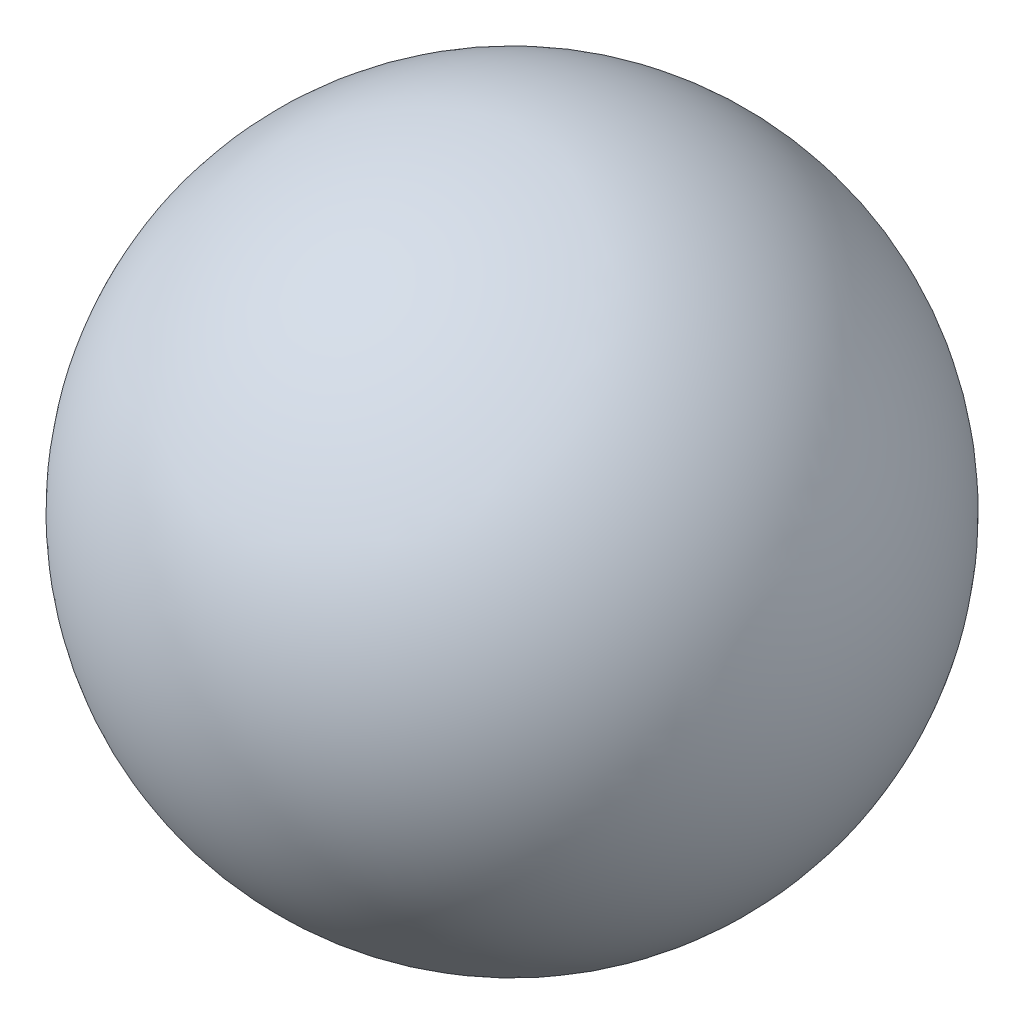
ISO-10303-21;
HEADER;
FILE_DESCRIPTION(('STEP AP214'),'2;1');
FILE_NAME('part.step','',(''),(''),'','','');
FILE_SCHEMA(('AUTOMOTIVE_DESIGN { 1 0 10303 214 1 1 1 1 }'));
ENDSEC;
DATA;
#1=APPLICATION_CONTEXT('core data for automotive mechanical design processes');
#2=APPLICATION_PROTOCOL_DEFINITION('international standard','automotive_design',2000,#1);
#3=PRODUCT_CONTEXT('',#1,'mechanical');
#4=PRODUCT('Part','Part','',(#3));
#5=PRODUCT_RELATED_PRODUCT_CATEGORY('part','',(#4));
#6=PRODUCT_DEFINITION_FORMATION('','',#4);
#7=PRODUCT_DEFINITION_CONTEXT('part definition',#1,'design');
#8=PRODUCT_DEFINITION('design','',#6,#7);
#9=PRODUCT_DEFINITION_SHAPE('','',#8);
#10=(LENGTH_UNIT() NAMED_UNIT(*) SI_UNIT(.MILLI.,.METRE.));
#11=(NAMED_UNIT(*) PLANE_ANGLE_UNIT() SI_UNIT($,.RADIAN.));
#12=(NAMED_UNIT(*) SI_UNIT($,.STERADIAN.) SOLID_ANGLE_UNIT());
#13=UNCERTAINTY_MEASURE_WITH_UNIT(LENGTH_MEASURE(1.E-05),#10,'distance_accuracy_value','');
#14=(GEOMETRIC_REPRESENTATION_CONTEXT(3) GLOBAL_UNCERTAINTY_ASSIGNED_CONTEXT((#13)) GLOBAL_UNIT_ASSIGNED_CONTEXT((#10,
#11,#12)) REPRESENTATION_CONTEXT('',''));
#15=CARTESIAN_POINT('',(0.,0.,0.));
#16=DIRECTION('',(0.,0.,1.));
#17=DIRECTION('',(1.,0.,0.));
#18=AXIS2_PLACEMENT_3D('',#15,#16,#17);
#19=CARTESIAN_POINT('',(0.,0.,0.));
#20=DIRECTION('',(-1.,0.,0.));
#21=DIRECTION('',(0.,0.,1.));
#22=AXIS2_PLACEMENT_3D('',#19,#20,#21);
#23=SPHERICAL_SURFACE('',#22,4.45);
#24=CARTESIAN_POINT('',(-4.45,0.,0.));
#25=VERTEX_POINT('',#24);
#26=VERTEX_LOOP('',#25);
#27=FACE_BOUND('',#26,.T.);
#28=ADVANCED_FACE('F13',(#27),#23,.T.);
#29=CLOSED_SHELL('',(#28));
#30=MANIFOLD_SOLID_BREP('B1',#29);
#31=ADVANCED_BREP_SHAPE_REPRESENTATION('',(#18,#30),#14);
#32=SHAPE_DEFINITION_REPRESENTATION(#9,#31);
ENDSEC;
END-ISO-10303-21;
